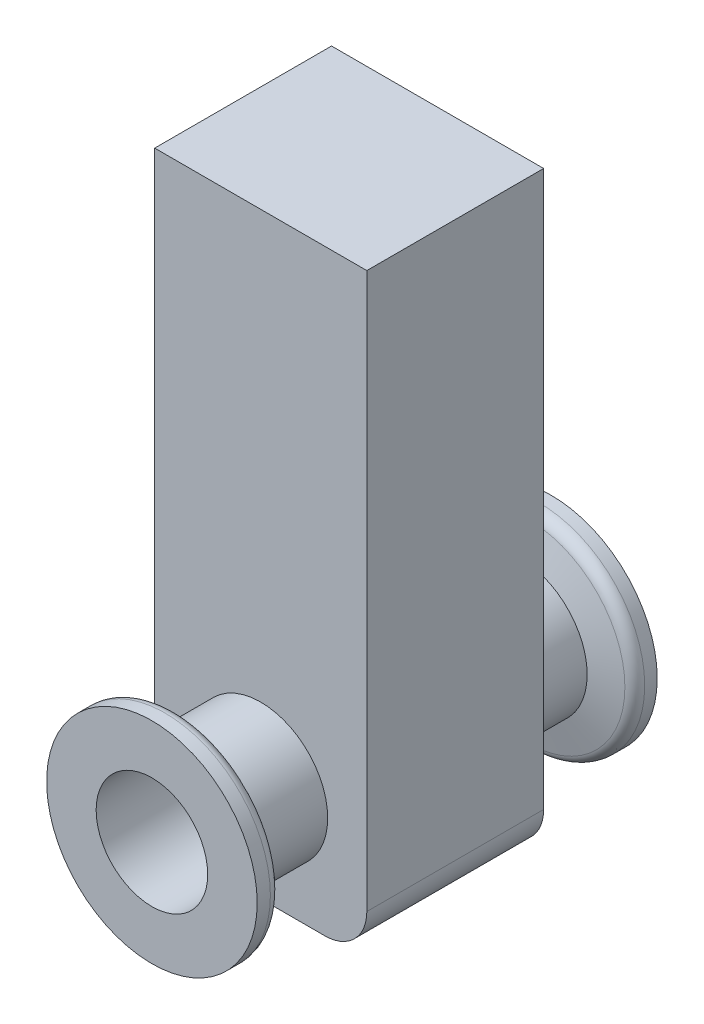
ISO-10303-21;
HEADER;
FILE_DESCRIPTION(('STEP AP214'),'2;1');
FILE_NAME('part.step','',(''),(''),'','','');
FILE_SCHEMA(('AUTOMOTIVE_DESIGN { 1 0 10303 214 1 1 1 1 }'));
ENDSEC;
DATA;
#1=APPLICATION_CONTEXT('core data for automotive mechanical design processes');
#2=APPLICATION_PROTOCOL_DEFINITION('international standard','automotive_design',2000,#1);
#3=PRODUCT_CONTEXT('',#1,'mechanical');
#4=PRODUCT('Part','Part','',(#3));
#5=PRODUCT_RELATED_PRODUCT_CATEGORY('part','',(#4));
#6=PRODUCT_DEFINITION_FORMATION('','',#4);
#7=PRODUCT_DEFINITION_CONTEXT('part definition',#1,'design');
#8=PRODUCT_DEFINITION('design','',#6,#7);
#9=PRODUCT_DEFINITION_SHAPE('','',#8);
#10=(LENGTH_UNIT() NAMED_UNIT(*) SI_UNIT(.MILLI.,.METRE.));
#11=(NAMED_UNIT(*) PLANE_ANGLE_UNIT() SI_UNIT($,.RADIAN.));
#12=(NAMED_UNIT(*) SI_UNIT($,.STERADIAN.) SOLID_ANGLE_UNIT());
#13=UNCERTAINTY_MEASURE_WITH_UNIT(LENGTH_MEASURE(1.E-05),#10,'distance_accuracy_value','');
#14=(GEOMETRIC_REPRESENTATION_CONTEXT(3) GLOBAL_UNCERTAINTY_ASSIGNED_CONTEXT((#13)) GLOBAL_UNIT_ASSIGNED_CONTEXT((#10,
#11,#12)) REPRESENTATION_CONTEXT('',''));
#15=CARTESIAN_POINT('',(0.,0.,0.));
#16=DIRECTION('',(0.,0.,1.));
#17=DIRECTION('',(1.,0.,0.));
#18=AXIS2_PLACEMENT_3D('',#15,#16,#17);
#19=CARTESIAN_POINT('',(15.096819971008,70.2713951502361,-12.5857));
#20=DIRECTION('',(0.,1.,0.));
#21=DIRECTION('',(0.,0.,1.));
#22=AXIS2_PLACEMENT_3D('',#19,#20,#21);
#23=PLANE('',#22);
#24=DIRECTION('',(-1.,0.,0.));
#25=VECTOR('',#24,1.);
#26=CARTESIAN_POINT('',(15.096819971008,70.2713951502361,12.5857));
#27=LINE('',#26,#25);
#28=CARTESIAN_POINT('',(15.096819971008,70.2713951502361,12.5857));
#29=VERTEX_POINT('',#28);
#30=CARTESIAN_POINT('',(-15.096819971008,70.2713951502361,12.5857));
#31=VERTEX_POINT('',#30);
#32=EDGE_CURVE('E122',#29,#31,#27,.T.);
#33=ORIENTED_EDGE('',*,*,#32,.F.);
#34=DIRECTION('',(0.,0.,1.));
#35=VECTOR('',#34,1.);
#36=CARTESIAN_POINT('',(15.096819971008,70.2713951502361,-12.5857));
#37=LINE('',#36,#35);
#38=CARTESIAN_POINT('',(15.096819971008,70.2713951502361,-12.5857));
#39=VERTEX_POINT('',#38);
#40=EDGE_CURVE('E44',#39,#29,#37,.T.);
#41=ORIENTED_EDGE('',*,*,#40,.F.);
#42=DIRECTION('',(-1.,0.,0.));
#43=VECTOR('',#42,1.);
#44=CARTESIAN_POINT('',(15.096819971008,70.2713951502361,-12.5857));
#45=LINE('',#44,#43);
#46=CARTESIAN_POINT('',(-15.096819971008,70.2713951502361,-12.5857));
#47=VERTEX_POINT('',#46);
#48=EDGE_CURVE('E138',#39,#47,#45,.T.);
#49=ORIENTED_EDGE('',*,*,#48,.T.);
#50=DIRECTION('',(0.,0.,1.));
#51=VECTOR('',#50,1.);
#52=CARTESIAN_POINT('',(-15.096819971008,70.2713951502361,-12.5857));
#53=LINE('',#52,#51);
#54=EDGE_CURVE('E86',#47,#31,#53,.T.);
#55=ORIENTED_EDGE('',*,*,#54,.T.);
#56=EDGE_LOOP('',(#33,#41,#49,#55));
#57=FACE_BOUND('',#56,.T.);
#58=ADVANCED_FACE('F35',(#57),#23,.T.);
#59=CARTESIAN_POINT('',(15.096819971008,-8.74510912954734,-12.5857));
#60=DIRECTION('',(1.,0.,0.));
#61=DIRECTION('',(0.,0.,-1.));
#62=AXIS2_PLACEMENT_3D('',#59,#60,#61);
#63=PLANE('',#62);
#64=DIRECTION('',(0.,1.,0.));
#65=VECTOR('',#64,1.);
#66=CARTESIAN_POINT('',(15.096819971008,-8.74510912954734,12.5857));
#67=LINE('',#66,#65);
#68=CARTESIAN_POINT('',(15.096819971008,-8.74510912954734,12.5857));
#69=VERTEX_POINT('',#68);
#70=EDGE_CURVE('E135',#69,#29,#67,.T.);
#71=ORIENTED_EDGE('',*,*,#70,.F.);
#72=DIRECTION('',(0.,0.,1.));
#73=VECTOR('',#72,1.);
#74=CARTESIAN_POINT('',(15.096819971008,-8.74510912954734,-12.5857));
#75=LINE('',#74,#73);
#76=CARTESIAN_POINT('',(15.096819971008,-8.74510912954734,-12.5857));
#77=VERTEX_POINT('',#76);
#78=EDGE_CURVE('E74',#77,#69,#75,.T.);
#79=ORIENTED_EDGE('',*,*,#78,.F.);
#80=DIRECTION('',(0.,1.,0.));
#81=VECTOR('',#80,1.);
#82=CARTESIAN_POINT('',(15.096819971008,-8.74510912954734,-12.5857));
#83=LINE('',#82,#81);
#84=EDGE_CURVE('E112',#77,#39,#83,.T.);
#85=ORIENTED_EDGE('',*,*,#84,.T.);
#86=ORIENTED_EDGE('',*,*,#40,.T.);
#87=EDGE_LOOP('',(#71,#79,#85,#86));
#88=FACE_BOUND('',#87,.T.);
#89=ADVANCED_FACE('F148',(#88),#63,.T.);
#90=CARTESIAN_POINT('',(9.11332425079144,-8.74510912954734,-12.5857));
#91=DIRECTION('',(0.,0.,1.));
#92=DIRECTION('',(1.,0.,0.));
#93=AXIS2_PLACEMENT_3D('',#90,#91,#92);
#94=CYLINDRICAL_SURFACE('',#93,5.9834957202166);
#95=CARTESIAN_POINT('',(9.11332425079144,-8.74510912954734,12.5857));
#96=DIRECTION('',(0.,0.,1.));
#97=DIRECTION('',(1.,0.,0.));
#98=AXIS2_PLACEMENT_3D('',#95,#96,#97);
#99=CIRCLE('',#98,5.9834957202166);
#100=CARTESIAN_POINT('',(9.11332425079144,-14.7286048497639,12.5857));
#101=VERTEX_POINT('',#100);
#102=EDGE_CURVE('E99',#101,#69,#99,.T.);
#103=ORIENTED_EDGE('',*,*,#102,.F.);
#104=DIRECTION('',(0.,0.,1.));
#105=VECTOR('',#104,1.);
#106=CARTESIAN_POINT('',(9.11332425079144,-14.7286048497639,-12.5857));
#107=LINE('',#106,#105);
#108=CARTESIAN_POINT('',(9.11332425079144,-14.7286048497639,-12.5857));
#109=VERTEX_POINT('',#108);
#110=EDGE_CURVE('E94',#109,#101,#107,.T.);
#111=ORIENTED_EDGE('',*,*,#110,.F.);
#112=CARTESIAN_POINT('',(9.11332425079144,-8.74510912954734,-12.5857));
#113=DIRECTION('',(0.,0.,1.));
#114=DIRECTION('',(1.,0.,0.));
#115=AXIS2_PLACEMENT_3D('',#112,#113,#114);
#116=CIRCLE('',#115,5.9834957202166);
#117=EDGE_CURVE('E97',#109,#77,#116,.T.);
#118=ORIENTED_EDGE('',*,*,#117,.T.);
#119=ORIENTED_EDGE('',*,*,#78,.T.);
#120=EDGE_LOOP('',(#103,#111,#118,#119));
#121=FACE_BOUND('',#120,.T.);
#122=ADVANCED_FACE('F96',(#121),#94,.T.);
#123=CARTESIAN_POINT('',(-9.11332425079144,-14.7286048497639,-12.5857));
#124=DIRECTION('',(0.,-1.,0.));
#125=DIRECTION('',(0.,0.,-1.));
#126=AXIS2_PLACEMENT_3D('',#123,#124,#125);
#127=PLANE('',#126);
#128=DIRECTION('',(1.,0.,0.));
#129=VECTOR('',#128,1.);
#130=CARTESIAN_POINT('',(-9.11332425079144,-14.7286048497639,12.5857));
#131=LINE('',#130,#129);
#132=CARTESIAN_POINT('',(-9.11332425079144,-14.7286048497639,12.5857));
#133=VERTEX_POINT('',#132);
#134=EDGE_CURVE('E132',#133,#101,#131,.T.);
#135=ORIENTED_EDGE('',*,*,#134,.F.);
#136=DIRECTION('',(0.,0.,1.));
#137=VECTOR('',#136,1.);
#138=CARTESIAN_POINT('',(-9.11332425079144,-14.7286048497639,-12.5857));
#139=LINE('',#138,#137);
#140=CARTESIAN_POINT('',(-9.11332425079144,-14.7286048497639,-12.5857));
#141=VERTEX_POINT('',#140);
#142=EDGE_CURVE('E104',#141,#133,#139,.T.);
#143=ORIENTED_EDGE('',*,*,#142,.F.);
#144=DIRECTION('',(1.,0.,0.));
#145=VECTOR('',#144,1.);
#146=CARTESIAN_POINT('',(-9.11332425079144,-14.7286048497639,-12.5857));
#147=LINE('',#146,#145);
#148=EDGE_CURVE('E110',#141,#109,#147,.T.);
#149=ORIENTED_EDGE('',*,*,#148,.T.);
#150=ORIENTED_EDGE('',*,*,#110,.T.);
#151=EDGE_LOOP('',(#135,#143,#149,#150));
#152=FACE_BOUND('',#151,.T.);
#153=ADVANCED_FACE('F114',(#152),#127,.T.);
#154=CARTESIAN_POINT('',(-9.11332425079144,-8.74510912954734,-12.5857));
#155=DIRECTION('',(0.,0.,1.));
#156=DIRECTION('',(1.,0.,0.));
#157=AXIS2_PLACEMENT_3D('',#154,#155,#156);
#158=CYLINDRICAL_SURFACE('',#157,5.9834957202166);
#159=CARTESIAN_POINT('',(-9.11332425079144,-8.74510912954734,12.5857));
#160=DIRECTION('',(0.,0.,1.));
#161=DIRECTION('',(1.,0.,0.));
#162=AXIS2_PLACEMENT_3D('',#159,#160,#161);
#163=CIRCLE('',#162,5.9834957202166);
#164=CARTESIAN_POINT('',(-15.096819971008,-8.74510912954734,12.5857));
#165=VERTEX_POINT('',#164);
#166=EDGE_CURVE('E129',#165,#133,#163,.T.);
#167=ORIENTED_EDGE('',*,*,#166,.F.);
#168=DIRECTION('',(0.,0.,1.));
#169=VECTOR('',#168,1.);
#170=CARTESIAN_POINT('',(-15.096819971008,-8.74510912954734,-12.5857));
#171=LINE('',#170,#169);
#172=CARTESIAN_POINT('',(-15.096819971008,-8.74510912954734,-12.5857));
#173=VERTEX_POINT('',#172);
#174=EDGE_CURVE('E142',#173,#165,#171,.T.);
#175=ORIENTED_EDGE('',*,*,#174,.F.);
#176=CARTESIAN_POINT('',(-9.11332425079144,-8.74510912954734,-12.5857));
#177=DIRECTION('',(0.,0.,1.));
#178=DIRECTION('',(1.,0.,0.));
#179=AXIS2_PLACEMENT_3D('',#176,#177,#178);
#180=CIRCLE('',#179,5.9834957202166);
#181=EDGE_CURVE('E115',#173,#141,#180,.T.);
#182=ORIENTED_EDGE('',*,*,#181,.T.);
#183=ORIENTED_EDGE('',*,*,#142,.T.);
#184=EDGE_LOOP('',(#167,#175,#182,#183));
#185=FACE_BOUND('',#184,.T.);
#186=ADVANCED_FACE('F161',(#185),#158,.T.);
#187=CARTESIAN_POINT('',(-15.096819971008,70.2713951502361,-12.5857));
#188=DIRECTION('',(-1.,0.,0.));
#189=DIRECTION('',(0.,0.,1.));
#190=AXIS2_PLACEMENT_3D('',#187,#188,#189);
#191=PLANE('',#190);
#192=DIRECTION('',(0.,-1.,0.));
#193=VECTOR('',#192,1.);
#194=CARTESIAN_POINT('',(-15.096819971008,70.2713951502361,12.5857));
#195=LINE('',#194,#193);
#196=EDGE_CURVE('E125',#31,#165,#195,.T.);
#197=ORIENTED_EDGE('',*,*,#196,.F.);
#198=ORIENTED_EDGE('',*,*,#54,.F.);
#199=DIRECTION('',(0.,-1.,0.));
#200=VECTOR('',#199,1.);
#201=CARTESIAN_POINT('',(-15.096819971008,70.2713951502361,-12.5857));
#202=LINE('',#201,#200);
#203=EDGE_CURVE('E117',#47,#173,#202,.T.);
#204=ORIENTED_EDGE('',*,*,#203,.T.);
#205=ORIENTED_EDGE('',*,*,#174,.T.);
#206=EDGE_LOOP('',(#197,#198,#204,#205));
#207=FACE_BOUND('',#206,.T.);
#208=ADVANCED_FACE('F144',(#207),#191,.T.);
#209=CARTESIAN_POINT('',(-9.11332425079144,-8.74510912954734,-12.5857));
#210=DIRECTION('',(0.,0.,1.));
#211=DIRECTION('',(1.,0.,0.));
#212=AXIS2_PLACEMENT_3D('',#209,#210,#211);
#213=PLANE('',#212);
#214=CARTESIAN_POINT('',(0.740743286399946,0.,-12.5857));
#215=DIRECTION('',(0.,0.,1.));
#216=DIRECTION('',(1.,0.,0.));
#217=AXIS2_PLACEMENT_3D('',#214,#215,#216);
#218=CIRCLE('',#217,9.56593300933521);
#219=CARTESIAN_POINT('',(10.3066762957352,0.,-12.5857));
#220=VERTEX_POINT('',#219);
#221=EDGE_CURVE('E249',#220,#220,#218,.T.);
#222=ORIENTED_EDGE('',*,*,#221,.T.);
#223=EDGE_LOOP('',(#222));
#224=FACE_BOUND('',#223,.T.);
#225=ORIENTED_EDGE('',*,*,#48,.F.);
#226=ORIENTED_EDGE('',*,*,#84,.F.);
#227=ORIENTED_EDGE('',*,*,#117,.F.);
#228=ORIENTED_EDGE('',*,*,#148,.F.);
#229=ORIENTED_EDGE('',*,*,#181,.F.);
#230=ORIENTED_EDGE('',*,*,#203,.F.);
#231=EDGE_LOOP('',(#225,#226,#227,#228,#229,#230));
#232=FACE_BOUND('',#231,.T.);
#233=ADVANCED_FACE('F108',(#224,#232),#213,.F.);
#234=CARTESIAN_POINT('',(-9.11332425079144,-8.74510912954734,12.5857));
#235=DIRECTION('',(0.,0.,1.));
#236=DIRECTION('',(1.,0.,0.));
#237=AXIS2_PLACEMENT_3D('',#234,#235,#236);
#238=PLANE('',#237);
#239=CARTESIAN_POINT('',(0.,0.,12.5857));
#240=DIRECTION('',(0.,0.,1.));
#241=DIRECTION('',(1.,0.,0.));
#242=AXIS2_PLACEMENT_3D('',#239,#240,#241);
#243=CIRCLE('',#242,9.52499999999483);
#244=CARTESIAN_POINT('',(9.52499999999483,0.,12.5857));
#245=VERTEX_POINT('',#244);
#246=EDGE_CURVE('E11',#245,#245,#243,.T.);
#247=ORIENTED_EDGE('',*,*,#246,.F.);
#248=EDGE_LOOP('',(#247));
#249=FACE_BOUND('',#248,.T.);
#250=ORIENTED_EDGE('',*,*,#32,.T.);
#251=ORIENTED_EDGE('',*,*,#196,.T.);
#252=ORIENTED_EDGE('',*,*,#166,.T.);
#253=ORIENTED_EDGE('',*,*,#134,.T.);
#254=ORIENTED_EDGE('',*,*,#102,.T.);
#255=ORIENTED_EDGE('',*,*,#70,.T.);
#256=EDGE_LOOP('',(#250,#251,#252,#253,#254,#255));
#257=FACE_BOUND('',#256,.T.);
#258=ADVANCED_FACE('F147',(#249,#257),#238,.T.);
#259=CARTESIAN_POINT('',(0.740743286399944,0.,-28.0796999999987));
#260=DIRECTION('',(0.,0.,1.));
#261=DIRECTION('',(1.,0.,0.));
#262=AXIS2_PLACEMENT_3D('',#259,#260,#261);
#263=CYLINDRICAL_SURFACE('',#262,15.0269330094051);
#264=CARTESIAN_POINT('',(0.740743286399944,0.,-28.0796999999987));
#265=DIRECTION('',(0.,0.,1.));
#266=DIRECTION('',(1.,0.,0.));
#267=AXIS2_PLACEMENT_3D('',#264,#265,#266);
#268=CIRCLE('',#267,15.0269330094051);
#269=CARTESIAN_POINT('',(15.7676762958051,0.,-28.0796999999987));
#270=VERTEX_POINT('',#269);
#271=EDGE_CURVE('E126',#270,#270,#268,.T.);
#272=ORIENTED_EDGE('',*,*,#271,.T.);
#273=EDGE_LOOP('',(#272));
#274=FACE_BOUND('',#273,.T.);
#275=CARTESIAN_POINT('',(0.740743286399944,0.,-26.2985568571613));
#276=DIRECTION('',(0.,0.,1.));
#277=DIRECTION('',(1.,0.,0.));
#278=AXIS2_PLACEMENT_3D('',#275,#276,#277);
#279=CIRCLE('',#278,15.0269330094051);
#280=CARTESIAN_POINT('',(15.7676762958051,0.,-26.2985568571613));
#281=VERTEX_POINT('',#280);
#282=EDGE_CURVE('E240',#281,#281,#279,.T.);
#283=ORIENTED_EDGE('',*,*,#282,.F.);
#284=EDGE_LOOP('',(#283));
#285=FACE_BOUND('',#284,.T.);
#286=ADVANCED_FACE('F172',(#274,#285),#263,.T.);
#287=CARTESIAN_POINT('',(15.7676762958051,0.,-28.0796999999987));
#288=DIRECTION('',(0.,0.,-1.));
#289=DIRECTION('',(-1.,0.,0.));
#290=AXIS2_PLACEMENT_3D('',#287,#288,#289);
#291=PLANE('',#290);
#292=CARTESIAN_POINT('',(0.,0.,-28.0796999999987));
#293=DIRECTION('',(0.,0.,-1.));
#294=DIRECTION('',(-1.,0.,0.));
#295=AXIS2_PLACEMENT_3D('',#292,#293,#294);
#296=CIRCLE('',#295,7.9375);
#297=CARTESIAN_POINT('',(-7.9375,0.,-28.0796999999987));
#298=VERTEX_POINT('',#297);
#299=EDGE_CURVE('E223',#298,#298,#296,.T.);
#300=ORIENTED_EDGE('',*,*,#299,.F.);
#301=EDGE_LOOP('',(#300));
#302=FACE_BOUND('',#301,.T.);
#303=ORIENTED_EDGE('',*,*,#271,.F.);
#304=EDGE_LOOP('',(#303));
#305=FACE_BOUND('',#304,.T.);
#306=ADVANCED_FACE('F178',(#302,#305),#291,.T.);
#307=CARTESIAN_POINT('',(0.740743286399944,0.,-28.0796999999987));
#308=DIRECTION('',(0.,0.,1.));
#309=DIRECTION('',(1.,0.,0.));
#310=AXIS2_PLACEMENT_3D('',#307,#308,#309);
#311=CYLINDRICAL_SURFACE('',#310,9.56593300933521);
#312=CARTESIAN_POINT('',(0.740743286399945,0.,-23.5684294601258));
#313=DIRECTION('',(0.,0.,1.));
#314=DIRECTION('',(1.,0.,0.));
#315=AXIS2_PLACEMENT_3D('',#312,#313,#314);
#316=CIRCLE('',#315,9.56593300933521);
#317=CARTESIAN_POINT('',(10.3066762957352,0.,-23.5684294601258));
#318=VERTEX_POINT('',#317);
#319=EDGE_CURVE('E246',#318,#318,#316,.T.);
#320=ORIENTED_EDGE('',*,*,#319,.T.);
#321=EDGE_LOOP('',(#320));
#322=FACE_BOUND('',#321,.T.);
#323=ORIENTED_EDGE('',*,*,#221,.F.);
#324=EDGE_LOOP('',(#323));
#325=FACE_BOUND('',#324,.T.);
#326=ADVANCED_FACE('F182',(#322,#325),#311,.T.);
#327=CARTESIAN_POINT('',(0.740743286399945,0.,-23.5684294601258));
#328=DIRECTION('',(0.,0.,-1.));
#329=DIRECTION('',(-1.,0.,0.));
#330=AXIS2_PLACEMENT_3D('',#327,#328,#329);
#331=CONICAL_SURFACE('',#330,9.56593300933521,1.3089969389966);
#332=CARTESIAN_POINT('',(0.740743286399944,0.,-24.7038133179564));
#333=DIRECTION('',(0.,0.,1.));
#334=DIRECTION('',(1.,0.,0.));
#335=AXIS2_PLACEMENT_3D('',#332,#333,#334);
#336=CIRCLE('',#335,13.803243252867);
#337=CARTESIAN_POINT('',(14.543986539267,0.,-24.7038133179564));
#338=VERTEX_POINT('',#337);
#339=EDGE_CURVE('E243',#338,#338,#336,.T.);
#340=ORIENTED_EDGE('',*,*,#339,.T.);
#341=EDGE_LOOP('',(#340));
#342=FACE_BOUND('',#341,.T.);
#343=ORIENTED_EDGE('',*,*,#319,.F.);
#344=EDGE_LOOP('',(#343));
#345=FACE_BOUND('',#344,.T.);
#346=ADVANCED_FACE('F186',(#342,#345),#331,.T.);
#347=CARTESIAN_POINT('',(0.740743286399944,0.,-26.2985568571613));
#348=DIRECTION('',(0.,0.,1.));
#349=DIRECTION('',(1.,0.,0.));
#350=AXIS2_PLACEMENT_3D('',#347,#348,#349);
#351=TOROIDAL_SURFACE('',#350,13.3759330094038,1.65100000000135);
#352=ORIENTED_EDGE('',*,*,#282,.T.);
#353=EDGE_LOOP('',(#352));
#354=FACE_BOUND('',#353,.T.);
#355=ORIENTED_EDGE('',*,*,#339,.F.);
#356=EDGE_LOOP('',(#355));
#357=FACE_BOUND('',#356,.T.);
#358=ADVANCED_FACE('F190',(#354,#357),#351,.T.);
#359=CARTESIAN_POINT('',(0.,0.,28.079699999996));
#360=DIRECTION('',(0.,0.,1.));
#361=DIRECTION('',(1.,0.,0.));
#362=AXIS2_PLACEMENT_3D('',#359,#360,#361);
#363=PLANE('',#362);
#364=CARTESIAN_POINT('',(0.,0.,28.079699999996));
#365=DIRECTION('',(0.,0.,1.));
#366=DIRECTION('',(1.,0.,0.));
#367=AXIS2_PLACEMENT_3D('',#364,#365,#366);
#368=CIRCLE('',#367,7.9375);
#369=CARTESIAN_POINT('',(7.9375,0.,28.079699999996));
#370=VERTEX_POINT('',#369);
#371=EDGE_CURVE('E38',#370,#370,#368,.T.);
#372=ORIENTED_EDGE('',*,*,#371,.F.);
#373=EDGE_LOOP('',(#372));
#374=FACE_BOUND('',#373,.T.);
#375=CARTESIAN_POINT('',(0.,0.,28.079699999996));
#376=DIRECTION('',(0.,0.,1.));
#377=DIRECTION('',(1.,0.,0.));
#378=AXIS2_PLACEMENT_3D('',#375,#376,#377);
#379=CIRCLE('',#378,14.986);
#380=CARTESIAN_POINT('',(14.986,0.,28.079699999996));
#381=VERTEX_POINT('',#380);
#382=EDGE_CURVE('E237',#381,#381,#379,.T.);
#383=ORIENTED_EDGE('',*,*,#382,.T.);
#384=EDGE_LOOP('',(#383));
#385=FACE_BOUND('',#384,.T.);
#386=ADVANCED_FACE('F194',(#374,#385),#363,.T.);
#387=CARTESIAN_POINT('',(0.,0.,3.06069999999604));
#388=DIRECTION('',(0.,0.,1.));
#389=DIRECTION('',(1.,0.,0.));
#390=AXIS2_PLACEMENT_3D('',#387,#388,#389);
#391=CYLINDRICAL_SURFACE('',#390,14.986);
#392=CARTESIAN_POINT('',(0.,0.,26.2011063296826));
#393=DIRECTION('',(0.,0.,1.));
#394=DIRECTION('',(1.,0.,0.));
#395=AXIS2_PLACEMENT_3D('',#392,#393,#394);
#396=CIRCLE('',#395,14.986);
#397=CARTESIAN_POINT('',(14.986,0.,26.2011063296826));
#398=VERTEX_POINT('',#397);
#399=EDGE_CURVE('E234',#398,#398,#396,.T.);
#400=ORIENTED_EDGE('',*,*,#399,.T.);
#401=EDGE_LOOP('',(#400));
#402=FACE_BOUND('',#401,.T.);
#403=ORIENTED_EDGE('',*,*,#382,.F.);
#404=EDGE_LOOP('',(#403));
#405=FACE_BOUND('',#404,.T.);
#406=ADVANCED_FACE('F198',(#402,#405),#391,.T.);
#407=CARTESIAN_POINT('',(0.,0.,26.2011063296826));
#408=DIRECTION('',(0.,0.,1.));
#409=DIRECTION('',(1.,0.,0.));
#410=AXIS2_PLACEMENT_3D('',#407,#408,#409);
#411=TOROIDAL_SURFACE('',#410,13.4619999999959,1.5240000000041);
#412=CARTESIAN_POINT('',(0.,0.,24.7290353704146));
#413=DIRECTION('',(0.,0.,1.));
#414=DIRECTION('',(1.,0.,0.));
#415=AXIS2_PLACEMENT_3D('',#412,#413,#414);
#416=CIRCLE('',#415,13.8564402247351);
#417=CARTESIAN_POINT('',(13.8564402247351,0.,24.7290353704146));
#418=VERTEX_POINT('',#417);
#419=EDGE_CURVE('E229',#418,#418,#416,.T.);
#420=ORIENTED_EDGE('',*,*,#419,.T.);
#421=EDGE_LOOP('',(#420));
#422=FACE_BOUND('',#421,.T.);
#423=ORIENTED_EDGE('',*,*,#399,.F.);
#424=EDGE_LOOP('',(#423));
#425=FACE_BOUND('',#424,.T.);
#426=ADVANCED_FACE('F202',(#422,#425),#411,.T.);
#427=CARTESIAN_POINT('',(0.,0.,24.7290353704146));
#428=DIRECTION('',(0.,0.,1.));
#429=DIRECTION('',(1.,0.,0.));
#430=AXIS2_PLACEMENT_3D('',#427,#428,#429);
#431=CONICAL_SURFACE('',#430,13.8564402247351,1.30899693899445);
#432=CARTESIAN_POINT('',(0.,0.,23.5684294601258));
#433=DIRECTION('',(0.,0.,1.));
#434=DIRECTION('',(1.,0.,0.));
#435=AXIS2_PLACEMENT_3D('',#432,#433,#434);
#436=CIRCLE('',#435,9.52499999999483);
#437=CARTESIAN_POINT('',(9.52499999999483,0.,23.5684294601258));
#438=VERTEX_POINT('',#437);
#439=EDGE_CURVE('E226',#438,#438,#436,.T.);
#440=ORIENTED_EDGE('',*,*,#439,.T.);
#441=EDGE_LOOP('',(#440));
#442=FACE_BOUND('',#441,.T.);
#443=ORIENTED_EDGE('',*,*,#419,.F.);
#444=EDGE_LOOP('',(#443));
#445=FACE_BOUND('',#444,.T.);
#446=ADVANCED_FACE('F206',(#442,#445),#431,.T.);
#447=CARTESIAN_POINT('',(0.,0.,3.06069999999604));
#448=DIRECTION('',(0.,0.,1.));
#449=DIRECTION('',(1.,0.,0.));
#450=AXIS2_PLACEMENT_3D('',#447,#448,#449);
#451=CYLINDRICAL_SURFACE('',#450,9.52499999999483);
#452=ORIENTED_EDGE('',*,*,#246,.T.);
#453=EDGE_LOOP('',(#452));
#454=FACE_BOUND('',#453,.T.);
#455=ORIENTED_EDGE('',*,*,#439,.F.);
#456=EDGE_LOOP('',(#455));
#457=FACE_BOUND('',#456,.T.);
#458=ADVANCED_FACE('F210',(#454,#457),#451,.T.);
#459=CARTESIAN_POINT('',(0.,0.,37.6047));
#460=DIRECTION('',(0.,0.,-1.));
#461=DIRECTION('',(-1.,0.,0.));
#462=AXIS2_PLACEMENT_3D('',#459,#460,#461);
#463=CYLINDRICAL_SURFACE('',#462,7.9375);
#464=ORIENTED_EDGE('',*,*,#299,.T.);
#465=EDGE_LOOP('',(#464));
#466=FACE_BOUND('',#465,.T.);
#467=ORIENTED_EDGE('',*,*,#371,.T.);
#468=EDGE_LOOP('',(#467));
#469=FACE_BOUND('',#468,.T.);
#470=ADVANCED_FACE('F214',(#466,#469),#463,.F.);
#471=CLOSED_SHELL('',(#58,#89,#122,#153,#186,#208,#233,#258,#286,#306,#326,#346,#358,#386,#406,
#426,#446,#458,#470));
#472=MANIFOLD_SOLID_BREP('B2',#471);
#473=ADVANCED_BREP_SHAPE_REPRESENTATION('',(#18,#472),#14);
#474=SHAPE_DEFINITION_REPRESENTATION(#9,#473);
ENDSEC;
END-ISO-10303-21;
